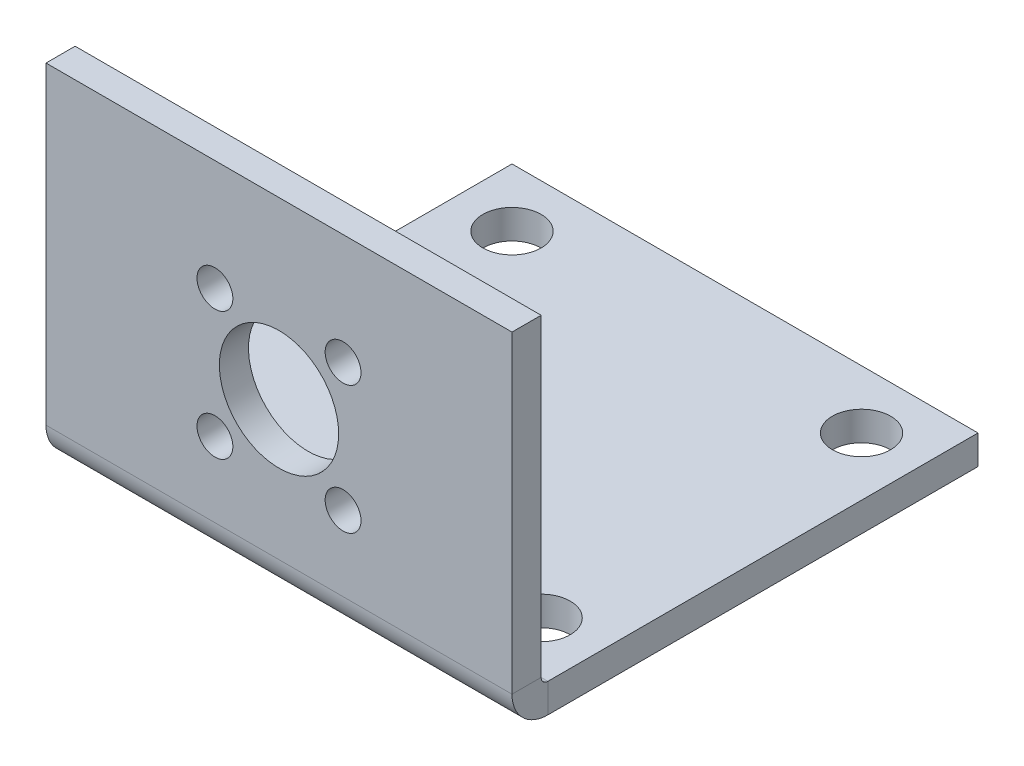
ISO-10303-21;
HEADER;
FILE_DESCRIPTION(('STEP AP214'),'2;1');
FILE_NAME('part.step','',(''),(''),'','','');
FILE_SCHEMA(('AUTOMOTIVE_DESIGN { 1 0 10303 214 1 1 1 1 }'));
ENDSEC;
DATA;
#1=APPLICATION_CONTEXT('core data for automotive mechanical design processes');
#2=APPLICATION_PROTOCOL_DEFINITION('international standard','automotive_design',2000,#1);
#3=PRODUCT_CONTEXT('',#1,'mechanical');
#4=PRODUCT('Part','Part','',(#3));
#5=PRODUCT_RELATED_PRODUCT_CATEGORY('part','',(#4));
#6=PRODUCT_DEFINITION_FORMATION('','',#4);
#7=PRODUCT_DEFINITION_CONTEXT('part definition',#1,'design');
#8=PRODUCT_DEFINITION('design','',#6,#7);
#9=PRODUCT_DEFINITION_SHAPE('','',#8);
#10=(LENGTH_UNIT() NAMED_UNIT(*) SI_UNIT(.MILLI.,.METRE.));
#11=(NAMED_UNIT(*) PLANE_ANGLE_UNIT() SI_UNIT($,.RADIAN.));
#12=(NAMED_UNIT(*) SI_UNIT($,.STERADIAN.) SOLID_ANGLE_UNIT());
#13=UNCERTAINTY_MEASURE_WITH_UNIT(LENGTH_MEASURE(1.E-05),#10,'distance_accuracy_value','');
#14=(GEOMETRIC_REPRESENTATION_CONTEXT(3) GLOBAL_UNCERTAINTY_ASSIGNED_CONTEXT((#13)) GLOBAL_UNIT_ASSIGNED_CONTEXT((#10,
#11,#12)) REPRESENTATION_CONTEXT('',''));
#15=CARTESIAN_POINT('',(0.,0.,0.));
#16=DIRECTION('',(0.,0.,1.));
#17=DIRECTION('',(1.,0.,0.));
#18=AXIS2_PLACEMENT_3D('',#15,#16,#17);
#19=CARTESIAN_POINT('',(25.4,3.91160000000004,0.));
#20=DIRECTION('',(1.,0.,0.));
#21=DIRECTION('',(0.,0.,-1.));
#22=AXIS2_PLACEMENT_3D('',#19,#20,#21);
#23=PLANE('',#22);
#24=DIRECTION('',(0.,0.,-1.));
#25=VECTOR('',#24,1.);
#26=CARTESIAN_POINT('',(25.4,3.91160000000004,0.));
#27=LINE('',#26,#25);
#28=CARTESIAN_POINT('',(25.4,3.91160000000004,0.));
#29=VERTEX_POINT('',#28);
#30=CARTESIAN_POINT('',(25.4,3.91160000000001,-3.175));
#31=VERTEX_POINT('',#30);
#32=EDGE_CURVE('E11',#29,#31,#27,.T.);
#33=ORIENTED_EDGE('',*,*,#32,.F.);
#34=CARTESIAN_POINT('',(25.4,3.91160000000001,-3.9116));
#35=DIRECTION('',(-1.,0.,0.));
#36=DIRECTION('',(0.,0.,1.));
#37=AXIS2_PLACEMENT_3D('',#34,#35,#36);
#38=CIRCLE('',#37,3.9116);
#39=CARTESIAN_POINT('',(25.4,0.,-3.9116));
#40=VERTEX_POINT('',#39);
#41=EDGE_CURVE('E127',#29,#40,#38,.F.);
#42=ORIENTED_EDGE('',*,*,#41,.T.);
#43=DIRECTION('',(0.,-1.,0.));
#44=VECTOR('',#43,1.);
#45=CARTESIAN_POINT('',(25.4,3.175,-3.9116));
#46=LINE('',#45,#44);
#47=CARTESIAN_POINT('',(25.4,3.175,-3.9116));
#48=VERTEX_POINT('',#47);
#49=EDGE_CURVE('E45',#48,#40,#46,.T.);
#50=ORIENTED_EDGE('',*,*,#49,.F.);
#51=CARTESIAN_POINT('',(25.4,3.91160000000001,-3.9116));
#52=DIRECTION('',(1.,0.,0.));
#53=DIRECTION('',(0.,0.,-1.));
#54=AXIS2_PLACEMENT_3D('',#51,#52,#53);
#55=CIRCLE('',#54,0.7366);
#56=EDGE_CURVE('E134',#31,#48,#55,.T.);
#57=ORIENTED_EDGE('',*,*,#56,.F.);
#58=EDGE_LOOP('',(#33,#42,#50,#57));
#59=FACE_BOUND('',#58,.T.);
#60=ADVANCED_FACE('F37',(#59),#23,.T.);
#61=CARTESIAN_POINT('',(25.4,3.175,-3.9116));
#62=DIRECTION('',(1.,0.,0.));
#63=DIRECTION('',(0.,0.,-1.));
#64=AXIS2_PLACEMENT_3D('',#61,#62,#63);
#65=PLANE('',#64);
#66=DIRECTION('',(0.,-1.,0.));
#67=VECTOR('',#66,1.);
#68=CARTESIAN_POINT('',(25.4,38.1,0.));
#69=LINE('',#68,#67);
#70=CARTESIAN_POINT('',(25.4,38.1,0.));
#71=VERTEX_POINT('',#70);
#72=EDGE_CURVE('E122',#71,#29,#69,.T.);
#73=ORIENTED_EDGE('',*,*,#72,.T.);
#74=ORIENTED_EDGE('',*,*,#32,.T.);
#75=DIRECTION('',(0.,-1.,0.));
#76=VECTOR('',#75,1.);
#77=CARTESIAN_POINT('',(25.4,38.1,-3.175));
#78=LINE('',#77,#76);
#79=CARTESIAN_POINT('',(25.4,38.1,-3.175));
#80=VERTEX_POINT('',#79);
#81=EDGE_CURVE('E132',#80,#31,#78,.T.);
#82=ORIENTED_EDGE('',*,*,#81,.F.);
#83=DIRECTION('',(0.,0.,-1.));
#84=VECTOR('',#83,1.);
#85=CARTESIAN_POINT('',(25.4,38.1,0.));
#86=LINE('',#85,#84);
#87=EDGE_CURVE('E113',#71,#80,#86,.T.);
#88=ORIENTED_EDGE('',*,*,#87,.F.);
#89=EDGE_LOOP('',(#73,#74,#82,#88));
#90=FACE_BOUND('',#89,.T.);
#91=ADVANCED_FACE('F130',(#90),#65,.T.);
#92=CARTESIAN_POINT('',(-25.4,0.,-3.9116));
#93=DIRECTION('',(-1.,0.,0.));
#94=DIRECTION('',(0.,0.,1.));
#95=AXIS2_PLACEMENT_3D('',#92,#93,#94);
#96=PLANE('',#95);
#97=DIRECTION('',(0.,1.,0.));
#98=VECTOR('',#97,1.);
#99=CARTESIAN_POINT('',(-25.4,0.,-3.9116));
#100=LINE('',#99,#98);
#101=CARTESIAN_POINT('',(-25.4,0.,-3.9116));
#102=VERTEX_POINT('',#101);
#103=CARTESIAN_POINT('',(-25.4,3.175,-3.9116));
#104=VERTEX_POINT('',#103);
#105=EDGE_CURVE('E88',#102,#104,#100,.T.);
#106=ORIENTED_EDGE('',*,*,#105,.F.);
#107=CARTESIAN_POINT('',(-25.4,3.91160000000001,-3.9116));
#108=DIRECTION('',(-1.,0.,0.));
#109=DIRECTION('',(0.,0.,1.));
#110=AXIS2_PLACEMENT_3D('',#107,#108,#109);
#111=CIRCLE('',#110,3.9116);
#112=CARTESIAN_POINT('',(-25.4,3.91160000000004,0.));
#113=VERTEX_POINT('',#112);
#114=EDGE_CURVE('E157',#113,#102,#111,.F.);
#115=ORIENTED_EDGE('',*,*,#114,.F.);
#116=DIRECTION('',(0.,0.,1.));
#117=VECTOR('',#116,1.);
#118=CARTESIAN_POINT('',(-25.4,3.91160000000001,-3.175));
#119=LINE('',#118,#117);
#120=CARTESIAN_POINT('',(-25.4,3.91160000000001,-3.175));
#121=VERTEX_POINT('',#120);
#122=EDGE_CURVE('E81',#121,#113,#119,.T.);
#123=ORIENTED_EDGE('',*,*,#122,.F.);
#124=CARTESIAN_POINT('',(-25.4,3.91160000000001,-3.9116));
#125=DIRECTION('',(1.,0.,0.));
#126=DIRECTION('',(0.,0.,-1.));
#127=AXIS2_PLACEMENT_3D('',#124,#125,#126);
#128=CIRCLE('',#127,0.7366);
#129=EDGE_CURVE('E150',#121,#104,#128,.T.);
#130=ORIENTED_EDGE('',*,*,#129,.T.);
#131=EDGE_LOOP('',(#106,#115,#123,#130));
#132=FACE_BOUND('',#131,.T.);
#133=ADVANCED_FACE('F189',(#132),#96,.T.);
#134=CARTESIAN_POINT('',(-25.4,3.91160000000001,-3.175));
#135=DIRECTION('',(-1.,0.,0.));
#136=DIRECTION('',(0.,0.,1.));
#137=AXIS2_PLACEMENT_3D('',#134,#135,#136);
#138=PLANE('',#137);
#139=DIRECTION('',(0.,0.,-1.));
#140=VECTOR('',#139,1.);
#141=CARTESIAN_POINT('',(-25.4,0.,0.));
#142=LINE('',#141,#140);
#143=CARTESIAN_POINT('',(-25.4,0.,-50.8));
#144=VERTEX_POINT('',#143);
#145=EDGE_CURVE('E140',#102,#144,#142,.T.);
#146=ORIENTED_EDGE('',*,*,#145,.F.);
#147=ORIENTED_EDGE('',*,*,#105,.T.);
#148=DIRECTION('',(0.,0.,-1.));
#149=VECTOR('',#148,1.);
#150=CARTESIAN_POINT('',(-25.4,3.175,0.));
#151=LINE('',#150,#149);
#152=CARTESIAN_POINT('',(-25.4,3.175,-50.8));
#153=VERTEX_POINT('',#152);
#154=EDGE_CURVE('E147',#104,#153,#151,.T.);
#155=ORIENTED_EDGE('',*,*,#154,.T.);
#156=DIRECTION('',(0.,-1.,0.));
#157=VECTOR('',#156,1.);
#158=CARTESIAN_POINT('',(-25.4,3.175,-50.8));
#159=LINE('',#158,#157);
#160=EDGE_CURVE('E143',#153,#144,#159,.T.);
#161=ORIENTED_EDGE('',*,*,#160,.T.);
#162=EDGE_LOOP('',(#146,#147,#155,#161));
#163=FACE_BOUND('',#162,.T.);
#164=ADVANCED_FACE('F176',(#163),#138,.T.);
#165=CARTESIAN_POINT('',(25.4,0.,0.));
#166=DIRECTION('',(0.,1.,0.));
#167=DIRECTION('',(0.,0.,1.));
#168=AXIS2_PLACEMENT_3D('',#165,#166,#167);
#169=PLANE('',#168);
#170=CARTESIAN_POINT('',(-19.05,0.,-9.525));
#171=DIRECTION('',(0.,1.,0.));
#172=DIRECTION('',(0.,0.,1.));
#173=AXIS2_PLACEMENT_3D('',#170,#171,#172);
#174=CIRCLE('',#173,3.175);
#175=CARTESIAN_POINT('',(-19.05,0.,-6.35));
#176=VERTEX_POINT('',#175);
#177=EDGE_CURVE('E234',#176,#176,#174,.T.);
#178=ORIENTED_EDGE('',*,*,#177,.T.);
#179=EDGE_LOOP('',(#178));
#180=FACE_BOUND('',#179,.T.);
#181=CARTESIAN_POINT('',(19.05,0.,-44.45));
#182=DIRECTION('',(0.,1.,0.));
#183=DIRECTION('',(0.,0.,1.));
#184=AXIS2_PLACEMENT_3D('',#181,#182,#183);
#185=CIRCLE('',#184,3.175);
#186=CARTESIAN_POINT('',(19.05,0.,-41.275));
#187=VERTEX_POINT('',#186);
#188=EDGE_CURVE('E246',#187,#187,#185,.T.);
#189=ORIENTED_EDGE('',*,*,#188,.T.);
#190=EDGE_LOOP('',(#189));
#191=FACE_BOUND('',#190,.T.);
#192=CARTESIAN_POINT('',(19.05,0.,-9.525));
#193=DIRECTION('',(0.,1.,0.));
#194=DIRECTION('',(0.,0.,1.));
#195=AXIS2_PLACEMENT_3D('',#192,#193,#194);
#196=CIRCLE('',#195,3.175);
#197=CARTESIAN_POINT('',(19.05,0.,-6.35));
#198=VERTEX_POINT('',#197);
#199=EDGE_CURVE('E240',#198,#198,#196,.T.);
#200=ORIENTED_EDGE('',*,*,#199,.T.);
#201=EDGE_LOOP('',(#200));
#202=FACE_BOUND('',#201,.T.);
#203=CARTESIAN_POINT('',(-19.05,0.,-44.45));
#204=DIRECTION('',(0.,1.,0.));
#205=DIRECTION('',(0.,0.,1.));
#206=AXIS2_PLACEMENT_3D('',#203,#204,#205);
#207=CIRCLE('',#206,3.175);
#208=CARTESIAN_POINT('',(-19.05,0.,-41.275));
#209=VERTEX_POINT('',#208);
#210=EDGE_CURVE('E223',#209,#209,#207,.T.);
#211=ORIENTED_EDGE('',*,*,#210,.T.);
#212=EDGE_LOOP('',(#211));
#213=FACE_BOUND('',#212,.T.);
#214=ORIENTED_EDGE('',*,*,#145,.T.);
#215=DIRECTION('',(-1.,0.,0.));
#216=VECTOR('',#215,1.);
#217=CARTESIAN_POINT('',(25.4,0.,-50.8));
#218=LINE('',#217,#216);
#219=CARTESIAN_POINT('',(25.4,0.,-50.8));
#220=VERTEX_POINT('',#219);
#221=EDGE_CURVE('E171',#220,#144,#218,.T.);
#222=ORIENTED_EDGE('',*,*,#221,.F.);
#223=DIRECTION('',(0.,0.,-1.));
#224=VECTOR('',#223,1.);
#225=CARTESIAN_POINT('',(25.4,0.,0.));
#226=LINE('',#225,#224);
#227=EDGE_CURVE('E94',#40,#220,#226,.T.);
#228=ORIENTED_EDGE('',*,*,#227,.F.);
#229=DIRECTION('',(-1.,0.,0.));
#230=VECTOR('',#229,1.);
#231=CARTESIAN_POINT('',(25.4,0.,-3.9116));
#232=LINE('',#231,#230);
#233=EDGE_CURVE('E139',#40,#102,#232,.T.);
#234=ORIENTED_EDGE('',*,*,#233,.T.);
#235=EDGE_LOOP('',(#214,#222,#228,#234));
#236=FACE_BOUND('',#235,.T.);
#237=ADVANCED_FACE('F255',(#180,#191,#202,#213,#236),#169,.F.);
#238=CARTESIAN_POINT('',(25.4,3.175,-50.8));
#239=DIRECTION('',(0.,0.,-1.));
#240=DIRECTION('',(-1.,0.,0.));
#241=AXIS2_PLACEMENT_3D('',#238,#239,#240);
#242=PLANE('',#241);
#243=ORIENTED_EDGE('',*,*,#160,.F.);
#244=DIRECTION('',(-1.,0.,0.));
#245=VECTOR('',#244,1.);
#246=CARTESIAN_POINT('',(25.4,3.175,-50.8));
#247=LINE('',#246,#245);
#248=CARTESIAN_POINT('',(25.4,3.175,-50.8));
#249=VERTEX_POINT('',#248);
#250=EDGE_CURVE('E169',#249,#153,#247,.T.);
#251=ORIENTED_EDGE('',*,*,#250,.F.);
#252=DIRECTION('',(0.,-1.,0.));
#253=VECTOR('',#252,1.);
#254=CARTESIAN_POINT('',(25.4,3.175,-50.8));
#255=LINE('',#254,#253);
#256=EDGE_CURVE('E195',#249,#220,#255,.T.);
#257=ORIENTED_EDGE('',*,*,#256,.T.);
#258=ORIENTED_EDGE('',*,*,#221,.T.);
#259=EDGE_LOOP('',(#243,#251,#257,#258));
#260=FACE_BOUND('',#259,.T.);
#261=ADVANCED_FACE('F267',(#260),#242,.T.);
#262=CARTESIAN_POINT('',(25.4,3.175,0.));
#263=DIRECTION('',(0.,1.,0.));
#264=DIRECTION('',(0.,0.,1.));
#265=AXIS2_PLACEMENT_3D('',#262,#263,#264);
#266=PLANE('',#265);
#267=CARTESIAN_POINT('',(-19.05,3.175,-9.525));
#268=DIRECTION('',(0.,1.,0.));
#269=DIRECTION('',(0.,0.,1.));
#270=AXIS2_PLACEMENT_3D('',#267,#268,#269);
#271=CIRCLE('',#270,3.175);
#272=CARTESIAN_POINT('',(-19.05,3.175,-6.35));
#273=VERTEX_POINT('',#272);
#274=EDGE_CURVE('E249',#273,#273,#271,.T.);
#275=ORIENTED_EDGE('',*,*,#274,.F.);
#276=EDGE_LOOP('',(#275));
#277=FACE_BOUND('',#276,.T.);
#278=CARTESIAN_POINT('',(19.05,3.175,-44.45));
#279=DIRECTION('',(0.,1.,0.));
#280=DIRECTION('',(0.,0.,1.));
#281=AXIS2_PLACEMENT_3D('',#278,#279,#280);
#282=CIRCLE('',#281,3.175);
#283=CARTESIAN_POINT('',(19.05,3.175,-41.275));
#284=VERTEX_POINT('',#283);
#285=EDGE_CURVE('E243',#284,#284,#282,.T.);
#286=ORIENTED_EDGE('',*,*,#285,.F.);
#287=EDGE_LOOP('',(#286));
#288=FACE_BOUND('',#287,.T.);
#289=CARTESIAN_POINT('',(19.05,3.175,-9.525));
#290=DIRECTION('',(0.,1.,0.));
#291=DIRECTION('',(0.,0.,1.));
#292=AXIS2_PLACEMENT_3D('',#289,#290,#291);
#293=CIRCLE('',#292,3.175);
#294=CARTESIAN_POINT('',(19.05,3.175,-6.35));
#295=VERTEX_POINT('',#294);
#296=EDGE_CURVE('E237',#295,#295,#293,.T.);
#297=ORIENTED_EDGE('',*,*,#296,.F.);
#298=EDGE_LOOP('',(#297));
#299=FACE_BOUND('',#298,.T.);
#300=CARTESIAN_POINT('',(-19.05,3.175,-44.45));
#301=DIRECTION('',(0.,1.,0.));
#302=DIRECTION('',(0.,0.,1.));
#303=AXIS2_PLACEMENT_3D('',#300,#301,#302);
#304=CIRCLE('',#303,3.175);
#305=CARTESIAN_POINT('',(-19.05,3.175,-41.275));
#306=VERTEX_POINT('',#305);
#307=EDGE_CURVE('E231',#306,#306,#304,.T.);
#308=ORIENTED_EDGE('',*,*,#307,.F.);
#309=EDGE_LOOP('',(#308));
#310=FACE_BOUND('',#309,.T.);
#311=ORIENTED_EDGE('',*,*,#154,.F.);
#312=DIRECTION('',(-1.,0.,0.));
#313=VECTOR('',#312,1.);
#314=CARTESIAN_POINT('',(25.4,3.175,-3.9116));
#315=LINE('',#314,#313);
#316=EDGE_CURVE('E166',#48,#104,#315,.T.);
#317=ORIENTED_EDGE('',*,*,#316,.F.);
#318=DIRECTION('',(0.,0.,-1.));
#319=VECTOR('',#318,1.);
#320=CARTESIAN_POINT('',(25.4,3.175,0.));
#321=LINE('',#320,#319);
#322=EDGE_CURVE('E194',#48,#249,#321,.T.);
#323=ORIENTED_EDGE('',*,*,#322,.T.);
#324=ORIENTED_EDGE('',*,*,#250,.T.);
#325=EDGE_LOOP('',(#311,#317,#323,#324));
#326=FACE_BOUND('',#325,.T.);
#327=ADVANCED_FACE('F187',(#277,#288,#299,#310,#326),#266,.T.);
#328=CARTESIAN_POINT('',(25.4,3.91160000000001,-3.9116));
#329=DIRECTION('',(-1.,0.,0.));
#330=DIRECTION('',(0.,0.,1.));
#331=AXIS2_PLACEMENT_3D('',#328,#329,#330);
#332=CYLINDRICAL_SURFACE('',#331,0.7366);
#333=ORIENTED_EDGE('',*,*,#129,.F.);
#334=DIRECTION('',(-1.,0.,0.));
#335=VECTOR('',#334,1.);
#336=CARTESIAN_POINT('',(25.4,3.91160000000001,-3.175));
#337=LINE('',#336,#335);
#338=EDGE_CURVE('E163',#31,#121,#337,.T.);
#339=ORIENTED_EDGE('',*,*,#338,.F.);
#340=ORIENTED_EDGE('',*,*,#56,.T.);
#341=ORIENTED_EDGE('',*,*,#316,.T.);
#342=EDGE_LOOP('',(#333,#339,#340,#341));
#343=FACE_BOUND('',#342,.T.);
#344=ADVANCED_FACE('F182',(#343),#332,.F.);
#345=CARTESIAN_POINT('',(25.4,38.1,-3.175));
#346=DIRECTION('',(0.,0.,-1.));
#347=DIRECTION('',(0.,1.,0.));
#348=AXIS2_PLACEMENT_3D('',#345,#346,#347);
#349=PLANE('',#348);
#350=CARTESIAN_POINT('',(-6.985,26.0350000000002,-3.175));
#351=DIRECTION('',(0.,0.,-1.));
#352=DIRECTION('',(0.,1.,0.));
#353=AXIS2_PLACEMENT_3D('',#350,#351,#352);
#354=CIRCLE('',#353,1.95452999995083);
#355=CARTESIAN_POINT('',(-6.985,27.989529999951,-3.175));
#356=VERTEX_POINT('',#355);
#357=EDGE_CURVE('E206',#356,#356,#354,.T.);
#358=ORIENTED_EDGE('',*,*,#357,.F.);
#359=EDGE_LOOP('',(#358));
#360=FACE_BOUND('',#359,.T.);
#361=CARTESIAN_POINT('',(6.985,26.0350000000002,-3.175));
#362=DIRECTION('',(0.,0.,-1.));
#363=DIRECTION('',(0.,1.,0.));
#364=AXIS2_PLACEMENT_3D('',#361,#362,#363);
#365=CIRCLE('',#364,1.95452999997974);
#366=CARTESIAN_POINT('',(6.985,27.9895299999799,-3.175));
#367=VERTEX_POINT('',#366);
#368=EDGE_CURVE('E209',#367,#367,#365,.T.);
#369=ORIENTED_EDGE('',*,*,#368,.F.);
#370=EDGE_LOOP('',(#369));
#371=FACE_BOUND('',#370,.T.);
#372=CARTESIAN_POINT('',(6.985,12.0650000000002,-3.175));
#373=DIRECTION('',(0.,0.,-1.));
#374=DIRECTION('',(0.,1.,0.));
#375=AXIS2_PLACEMENT_3D('',#372,#373,#374);
#376=CIRCLE('',#375,1.95452999997974);
#377=CARTESIAN_POINT('',(6.985,14.0195299999799,-3.175));
#378=VERTEX_POINT('',#377);
#379=EDGE_CURVE('E212',#378,#378,#376,.T.);
#380=ORIENTED_EDGE('',*,*,#379,.F.);
#381=EDGE_LOOP('',(#380));
#382=FACE_BOUND('',#381,.T.);
#383=CARTESIAN_POINT('',(-6.985,12.0650000000002,-3.175));
#384=DIRECTION('',(0.,0.,-1.));
#385=DIRECTION('',(0.,1.,0.));
#386=AXIS2_PLACEMENT_3D('',#383,#384,#385);
#387=CIRCLE('',#386,1.95452999995083);
#388=CARTESIAN_POINT('',(-6.985,14.019529999951,-3.175));
#389=VERTEX_POINT('',#388);
#390=EDGE_CURVE('E215',#389,#389,#387,.T.);
#391=ORIENTED_EDGE('',*,*,#390,.F.);
#392=EDGE_LOOP('',(#391));
#393=FACE_BOUND('',#392,.T.);
#394=CARTESIAN_POINT('',(0.,19.0500000000001,-3.175));
#395=DIRECTION('',(0.,0.,-1.));
#396=DIRECTION('',(0.,1.,0.));
#397=AXIS2_PLACEMENT_3D('',#394,#395,#396);
#398=CIRCLE('',#397,6.50239999999999);
#399=CARTESIAN_POINT('',(0.,25.5524000000001,-3.175));
#400=VERTEX_POINT('',#399);
#401=EDGE_CURVE('E144',#400,#400,#398,.T.);
#402=ORIENTED_EDGE('',*,*,#401,.F.);
#403=EDGE_LOOP('',(#402));
#404=FACE_BOUND('',#403,.T.);
#405=DIRECTION('',(0.,-1.,0.));
#406=VECTOR('',#405,1.);
#407=CARTESIAN_POINT('',(-25.4,38.1,-3.175));
#408=LINE('',#407,#406);
#409=CARTESIAN_POINT('',(-25.4,38.1,-3.175));
#410=VERTEX_POINT('',#409);
#411=EDGE_CURVE('E152',#410,#121,#408,.T.);
#412=ORIENTED_EDGE('',*,*,#411,.F.);
#413=DIRECTION('',(-1.,0.,0.));
#414=VECTOR('',#413,1.);
#415=CARTESIAN_POINT('',(25.4,38.1,-3.175));
#416=LINE('',#415,#414);
#417=EDGE_CURVE('E117',#80,#410,#416,.T.);
#418=ORIENTED_EDGE('',*,*,#417,.F.);
#419=ORIENTED_EDGE('',*,*,#81,.T.);
#420=ORIENTED_EDGE('',*,*,#338,.T.);
#421=EDGE_LOOP('',(#412,#418,#419,#420));
#422=FACE_BOUND('',#421,.T.);
#423=ADVANCED_FACE('F192',(#360,#371,#382,#393,#404,#422),#349,.T.);
#424=CARTESIAN_POINT('',(25.4,38.1,0.));
#425=DIRECTION('',(0.,1.,0.));
#426=DIRECTION('',(0.,0.,1.));
#427=AXIS2_PLACEMENT_3D('',#424,#425,#426);
#428=PLANE('',#427);
#429=DIRECTION('',(0.,0.,-1.));
#430=VECTOR('',#429,1.);
#431=CARTESIAN_POINT('',(-25.4,38.1,0.));
#432=LINE('',#431,#430);
#433=CARTESIAN_POINT('',(-25.4,38.1,0.));
#434=VERTEX_POINT('',#433);
#435=EDGE_CURVE('E115',#434,#410,#432,.T.);
#436=ORIENTED_EDGE('',*,*,#435,.F.);
#437=DIRECTION('',(-1.,0.,0.));
#438=VECTOR('',#437,1.);
#439=CARTESIAN_POINT('',(25.4,38.1,0.));
#440=LINE('',#439,#438);
#441=EDGE_CURVE('E109',#71,#434,#440,.T.);
#442=ORIENTED_EDGE('',*,*,#441,.F.);
#443=ORIENTED_EDGE('',*,*,#87,.T.);
#444=ORIENTED_EDGE('',*,*,#417,.T.);
#445=EDGE_LOOP('',(#436,#442,#443,#444));
#446=FACE_BOUND('',#445,.T.);
#447=ADVANCED_FACE('F111',(#446),#428,.T.);
#448=CARTESIAN_POINT('',(25.4,38.1,0.));
#449=DIRECTION('',(0.,0.,-1.));
#450=DIRECTION('',(0.,1.,0.));
#451=AXIS2_PLACEMENT_3D('',#448,#449,#450);
#452=PLANE('',#451);
#453=CARTESIAN_POINT('',(-6.985,26.0350000000002,0.));
#454=DIRECTION('',(0.,0.,1.));
#455=DIRECTION('',(1.,0.,0.));
#456=AXIS2_PLACEMENT_3D('',#453,#454,#455);
#457=CIRCLE('',#456,1.95452999995083);
#458=CARTESIAN_POINT('',(-5.03047000004917,26.0350000000002,0.));
#459=VERTEX_POINT('',#458);
#460=EDGE_CURVE('E218',#459,#459,#457,.T.);
#461=ORIENTED_EDGE('',*,*,#460,.F.);
#462=EDGE_LOOP('',(#461));
#463=FACE_BOUND('',#462,.T.);
#464=CARTESIAN_POINT('',(6.985,26.0350000000002,0.));
#465=DIRECTION('',(0.,0.,1.));
#466=DIRECTION('',(1.,0.,0.));
#467=AXIS2_PLACEMENT_3D('',#464,#465,#466);
#468=CIRCLE('',#467,1.95452999997974);
#469=CARTESIAN_POINT('',(8.93952999997974,26.0350000000002,0.));
#470=VERTEX_POINT('',#469);
#471=EDGE_CURVE('E226',#470,#470,#468,.T.);
#472=ORIENTED_EDGE('',*,*,#471,.F.);
#473=EDGE_LOOP('',(#472));
#474=FACE_BOUND('',#473,.T.);
#475=CARTESIAN_POINT('',(6.985,12.0650000000002,0.));
#476=DIRECTION('',(0.,0.,1.));
#477=DIRECTION('',(1.,0.,0.));
#478=AXIS2_PLACEMENT_3D('',#475,#476,#477);
#479=CIRCLE('',#478,1.95452999997974);
#480=CARTESIAN_POINT('',(8.93952999997974,12.0650000000002,0.));
#481=VERTEX_POINT('',#480);
#482=EDGE_CURVE('E222',#481,#481,#479,.T.);
#483=ORIENTED_EDGE('',*,*,#482,.F.);
#484=EDGE_LOOP('',(#483));
#485=FACE_BOUND('',#484,.T.);
#486=CARTESIAN_POINT('',(-6.985,12.0650000000002,0.));
#487=DIRECTION('',(0.,0.,1.));
#488=DIRECTION('',(1.,0.,0.));
#489=AXIS2_PLACEMENT_3D('',#486,#487,#488);
#490=CIRCLE('',#489,1.95452999995083);
#491=CARTESIAN_POINT('',(-5.03047000004917,12.0650000000002,0.));
#492=VERTEX_POINT('',#491);
#493=EDGE_CURVE('E219',#492,#492,#490,.T.);
#494=ORIENTED_EDGE('',*,*,#493,.F.);
#495=EDGE_LOOP('',(#494));
#496=FACE_BOUND('',#495,.T.);
#497=CARTESIAN_POINT('',(0.,19.0500000000001,0.));
#498=DIRECTION('',(0.,0.,1.));
#499=DIRECTION('',(1.,0.,0.));
#500=AXIS2_PLACEMENT_3D('',#497,#498,#499);
#501=CIRCLE('',#500,6.50239999999999);
#502=CARTESIAN_POINT('',(6.50239999999999,19.0500000000001,0.));
#503=VERTEX_POINT('',#502);
#504=EDGE_CURVE('E203',#503,#503,#501,.T.);
#505=ORIENTED_EDGE('',*,*,#504,.F.);
#506=EDGE_LOOP('',(#505));
#507=FACE_BOUND('',#506,.T.);
#508=DIRECTION('',(0.,-1.,0.));
#509=VECTOR('',#508,1.);
#510=CARTESIAN_POINT('',(-25.4,38.1,0.));
#511=LINE('',#510,#509);
#512=EDGE_CURVE('E155',#434,#113,#511,.T.);
#513=ORIENTED_EDGE('',*,*,#512,.T.);
#514=DIRECTION('',(-1.,0.,0.));
#515=VECTOR('',#514,1.);
#516=CARTESIAN_POINT('',(25.4,3.91160000000004,0.));
#517=LINE('',#516,#515);
#518=EDGE_CURVE('E118',#29,#113,#517,.T.);
#519=ORIENTED_EDGE('',*,*,#518,.F.);
#520=ORIENTED_EDGE('',*,*,#72,.F.);
#521=ORIENTED_EDGE('',*,*,#441,.T.);
#522=EDGE_LOOP('',(#513,#519,#520,#521));
#523=FACE_BOUND('',#522,.T.);
#524=ADVANCED_FACE('F123',(#463,#474,#485,#496,#507,#523),#452,.F.);
#525=CARTESIAN_POINT('',(25.4,3.91160000000001,-3.9116));
#526=DIRECTION('',(-1.,0.,0.));
#527=DIRECTION('',(0.,0.,1.));
#528=AXIS2_PLACEMENT_3D('',#525,#526,#527);
#529=CYLINDRICAL_SURFACE('',#528,3.9116);
#530=ORIENTED_EDGE('',*,*,#114,.T.);
#531=ORIENTED_EDGE('',*,*,#233,.F.);
#532=ORIENTED_EDGE('',*,*,#41,.F.);
#533=ORIENTED_EDGE('',*,*,#518,.T.);
#534=EDGE_LOOP('',(#530,#531,#532,#533));
#535=FACE_BOUND('',#534,.T.);
#536=ADVANCED_FACE('F316',(#535),#529,.T.);
#537=CARTESIAN_POINT('',(25.4,3.91160000000001,-3.9116));
#538=DIRECTION('',(1.,0.,0.));
#539=DIRECTION('',(0.,0.,-1.));
#540=AXIS2_PLACEMENT_3D('',#537,#538,#539);
#541=PLANE('',#540);
#542=ORIENTED_EDGE('',*,*,#227,.T.);
#543=ORIENTED_EDGE('',*,*,#256,.F.);
#544=ORIENTED_EDGE('',*,*,#322,.F.);
#545=ORIENTED_EDGE('',*,*,#49,.T.);
#546=EDGE_LOOP('',(#542,#543,#544,#545));
#547=FACE_BOUND('',#546,.T.);
#548=ADVANCED_FACE('F320',(#547),#541,.T.);
#549=CARTESIAN_POINT('',(-25.4,3.91160000000001,-3.9116));
#550=DIRECTION('',(1.,0.,0.));
#551=DIRECTION('',(0.,0.,-1.));
#552=AXIS2_PLACEMENT_3D('',#549,#550,#551);
#553=PLANE('',#552);
#554=ORIENTED_EDGE('',*,*,#411,.T.);
#555=ORIENTED_EDGE('',*,*,#122,.T.);
#556=ORIENTED_EDGE('',*,*,#512,.F.);
#557=ORIENTED_EDGE('',*,*,#435,.T.);
#558=EDGE_LOOP('',(#554,#555,#556,#557));
#559=FACE_BOUND('',#558,.T.);
#560=ADVANCED_FACE('F322',(#559),#553,.F.);
#561=CARTESIAN_POINT('',(0.,19.0500000000001,-50.8));
#562=DIRECTION('',(0.,0.,1.));
#563=DIRECTION('',(1.,0.,0.));
#564=AXIS2_PLACEMENT_3D('',#561,#562,#563);
#565=CYLINDRICAL_SURFACE('',#564,6.50239999999999);
#566=ORIENTED_EDGE('',*,*,#401,.T.);
#567=EDGE_LOOP('',(#566));
#568=FACE_BOUND('',#567,.T.);
#569=ORIENTED_EDGE('',*,*,#504,.T.);
#570=EDGE_LOOP('',(#569));
#571=FACE_BOUND('',#570,.T.);
#572=ADVANCED_FACE('F325',(#568,#571),#565,.F.);
#573=CARTESIAN_POINT('',(-6.985,12.0650000000002,-50.8));
#574=DIRECTION('',(0.,0.,1.));
#575=DIRECTION('',(1.,0.,0.));
#576=AXIS2_PLACEMENT_3D('',#573,#574,#575);
#577=CYLINDRICAL_SURFACE('',#576,1.95452999995083);
#578=ORIENTED_EDGE('',*,*,#390,.T.);
#579=EDGE_LOOP('',(#578));
#580=FACE_BOUND('',#579,.T.);
#581=ORIENTED_EDGE('',*,*,#493,.T.);
#582=EDGE_LOOP('',(#581));
#583=FACE_BOUND('',#582,.T.);
#584=ADVANCED_FACE('F330',(#580,#583),#577,.F.);
#585=CARTESIAN_POINT('',(6.985,12.0650000000002,-50.8));
#586=DIRECTION('',(0.,0.,1.));
#587=DIRECTION('',(1.,0.,0.));
#588=AXIS2_PLACEMENT_3D('',#585,#586,#587);
#589=CYLINDRICAL_SURFACE('',#588,1.95452999997974);
#590=ORIENTED_EDGE('',*,*,#379,.T.);
#591=EDGE_LOOP('',(#590));
#592=FACE_BOUND('',#591,.T.);
#593=ORIENTED_EDGE('',*,*,#482,.T.);
#594=EDGE_LOOP('',(#593));
#595=FACE_BOUND('',#594,.T.);
#596=ADVANCED_FACE('F334',(#592,#595),#589,.F.);
#597=CARTESIAN_POINT('',(6.985,26.0350000000002,-50.8));
#598=DIRECTION('',(0.,0.,1.));
#599=DIRECTION('',(1.,0.,0.));
#600=AXIS2_PLACEMENT_3D('',#597,#598,#599);
#601=CYLINDRICAL_SURFACE('',#600,1.95452999997974);
#602=ORIENTED_EDGE('',*,*,#368,.T.);
#603=EDGE_LOOP('',(#602));
#604=FACE_BOUND('',#603,.T.);
#605=ORIENTED_EDGE('',*,*,#471,.T.);
#606=EDGE_LOOP('',(#605));
#607=FACE_BOUND('',#606,.T.);
#608=ADVANCED_FACE('F287',(#604,#607),#601,.F.);
#609=CARTESIAN_POINT('',(-6.985,26.0350000000002,-50.8));
#610=DIRECTION('',(0.,0.,1.));
#611=DIRECTION('',(1.,0.,0.));
#612=AXIS2_PLACEMENT_3D('',#609,#610,#611);
#613=CYLINDRICAL_SURFACE('',#612,1.95452999995083);
#614=ORIENTED_EDGE('',*,*,#357,.T.);
#615=EDGE_LOOP('',(#614));
#616=FACE_BOUND('',#615,.T.);
#617=ORIENTED_EDGE('',*,*,#460,.T.);
#618=EDGE_LOOP('',(#617));
#619=FACE_BOUND('',#618,.T.);
#620=ADVANCED_FACE('F278',(#616,#619),#613,.F.);
#621=CARTESIAN_POINT('',(-19.05,0.,-44.45));
#622=DIRECTION('',(0.,1.,0.));
#623=DIRECTION('',(0.,0.,1.));
#624=AXIS2_PLACEMENT_3D('',#621,#622,#623);
#625=CYLINDRICAL_SURFACE('',#624,3.175);
#626=ORIENTED_EDGE('',*,*,#210,.F.);
#627=EDGE_LOOP('',(#626));
#628=FACE_BOUND('',#627,.T.);
#629=ORIENTED_EDGE('',*,*,#307,.T.);
#630=EDGE_LOOP('',(#629));
#631=FACE_BOUND('',#630,.T.);
#632=ADVANCED_FACE('F275',(#628,#631),#625,.F.);
#633=CARTESIAN_POINT('',(19.05,0.,-9.525));
#634=DIRECTION('',(0.,1.,0.));
#635=DIRECTION('',(0.,0.,1.));
#636=AXIS2_PLACEMENT_3D('',#633,#634,#635);
#637=CYLINDRICAL_SURFACE('',#636,3.175);
#638=ORIENTED_EDGE('',*,*,#199,.F.);
#639=EDGE_LOOP('',(#638));
#640=FACE_BOUND('',#639,.T.);
#641=ORIENTED_EDGE('',*,*,#296,.T.);
#642=EDGE_LOOP('',(#641));
#643=FACE_BOUND('',#642,.T.);
#644=ADVANCED_FACE('F277',(#640,#643),#637,.F.);
#645=CARTESIAN_POINT('',(19.05,0.,-44.45));
#646=DIRECTION('',(0.,1.,0.));
#647=DIRECTION('',(0.,0.,1.));
#648=AXIS2_PLACEMENT_3D('',#645,#646,#647);
#649=CYLINDRICAL_SURFACE('',#648,3.175);
#650=ORIENTED_EDGE('',*,*,#188,.F.);
#651=EDGE_LOOP('',(#650));
#652=FACE_BOUND('',#651,.T.);
#653=ORIENTED_EDGE('',*,*,#285,.T.);
#654=EDGE_LOOP('',(#653));
#655=FACE_BOUND('',#654,.T.);
#656=ADVANCED_FACE('F261',(#652,#655),#649,.F.);
#657=CARTESIAN_POINT('',(-19.05,0.,-9.525));
#658=DIRECTION('',(0.,1.,0.));
#659=DIRECTION('',(0.,0.,1.));
#660=AXIS2_PLACEMENT_3D('',#657,#658,#659);
#661=CYLINDRICAL_SURFACE('',#660,3.175);
#662=ORIENTED_EDGE('',*,*,#177,.F.);
#663=EDGE_LOOP('',(#662));
#664=FACE_BOUND('',#663,.T.);
#665=ORIENTED_EDGE('',*,*,#274,.T.);
#666=EDGE_LOOP('',(#665));
#667=FACE_BOUND('',#666,.T.);
#668=ADVANCED_FACE('F258',(#664,#667),#661,.F.);
#669=CLOSED_SHELL('',(#60,#91,#133,#164,#237,#261,#327,#344,#423,#447,#524,#536,#548,#560,#572,
#584,#596,#608,#620,#632,#644,#656,#668));
#670=MANIFOLD_SOLID_BREP('B2',#669);
#671=ADVANCED_BREP_SHAPE_REPRESENTATION('',(#18,#670),#14);
#672=SHAPE_DEFINITION_REPRESENTATION(#9,#671);
ENDSEC;
END-ISO-10303-21;
